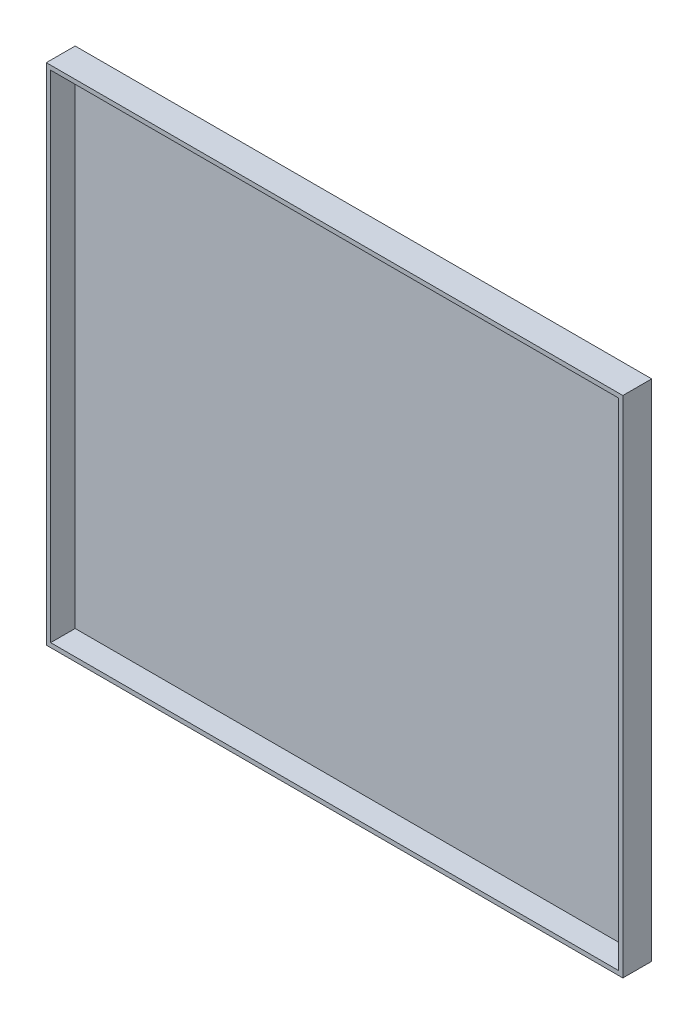
ISO-10303-21;
HEADER;
FILE_DESCRIPTION(('STEP AP214'),'2;1');
FILE_NAME('part.step','',(''),(''),'','','');
FILE_SCHEMA(('AUTOMOTIVE_DESIGN { 1 0 10303 214 1 1 1 1 }'));
ENDSEC;
DATA;
#1=APPLICATION_CONTEXT('core data for automotive mechanical design processes');
#2=APPLICATION_PROTOCOL_DEFINITION('international standard','automotive_design',2000,#1);
#3=PRODUCT_CONTEXT('',#1,'mechanical');
#4=PRODUCT('Part','Part','',(#3));
#5=PRODUCT_RELATED_PRODUCT_CATEGORY('part','',(#4));
#6=PRODUCT_DEFINITION_FORMATION('','',#4);
#7=PRODUCT_DEFINITION_CONTEXT('part definition',#1,'design');
#8=PRODUCT_DEFINITION('design','',#6,#7);
#9=PRODUCT_DEFINITION_SHAPE('','',#8);
#10=(LENGTH_UNIT() NAMED_UNIT(*) SI_UNIT(.MILLI.,.METRE.));
#11=(NAMED_UNIT(*) PLANE_ANGLE_UNIT() SI_UNIT($,.RADIAN.));
#12=(NAMED_UNIT(*) SI_UNIT($,.STERADIAN.) SOLID_ANGLE_UNIT());
#13=UNCERTAINTY_MEASURE_WITH_UNIT(LENGTH_MEASURE(1.E-05),#10,'distance_accuracy_value','');
#14=(GEOMETRIC_REPRESENTATION_CONTEXT(3) GLOBAL_UNCERTAINTY_ASSIGNED_CONTEXT((#13)) GLOBAL_UNIT_ASSIGNED_CONTEXT((#10,
#11,#12)) REPRESENTATION_CONTEXT('',''));
#15=CARTESIAN_POINT('',(0.,0.,0.));
#16=DIRECTION('',(0.,0.,1.));
#17=DIRECTION('',(1.,0.,0.));
#18=AXIS2_PLACEMENT_3D('',#15,#16,#17);
#19=CARTESIAN_POINT('',(200.,175.,20.));
#20=DIRECTION('',(-1.,0.,0.));
#21=DIRECTION('',(0.,-1.,0.));
#22=AXIS2_PLACEMENT_3D('',#19,#20,#21);
#23=PLANE('',#22);
#24=DIRECTION('',(0.,1.,0.));
#25=VECTOR('',#24,1.);
#26=CARTESIAN_POINT('',(200.,175.,0.));
#27=LINE('',#26,#25);
#28=CARTESIAN_POINT('',(200.,-175.,0.));
#29=VERTEX_POINT('',#28);
#30=CARTESIAN_POINT('',(200.,175.,0.));
#31=VERTEX_POINT('',#30);
#32=EDGE_CURVE('E149',#29,#31,#27,.T.);
#33=ORIENTED_EDGE('',*,*,#32,.T.);
#34=DIRECTION('',(0.,0.,-1.));
#35=VECTOR('',#34,1.);
#36=CARTESIAN_POINT('',(200.,175.,20.));
#37=LINE('',#36,#35);
#38=CARTESIAN_POINT('',(200.,175.,20.));
#39=VERTEX_POINT('',#38);
#40=EDGE_CURVE('E11',#39,#31,#37,.T.);
#41=ORIENTED_EDGE('',*,*,#40,.F.);
#42=DIRECTION('',(0.,1.,0.));
#43=VECTOR('',#42,1.);
#44=CARTESIAN_POINT('',(200.,175.,20.));
#45=LINE('',#44,#43);
#46=CARTESIAN_POINT('',(200.,-175.,20.));
#47=VERTEX_POINT('',#46);
#48=EDGE_CURVE('E142',#47,#39,#45,.T.);
#49=ORIENTED_EDGE('',*,*,#48,.F.);
#50=DIRECTION('',(0.,0.,-1.));
#51=VECTOR('',#50,1.);
#52=CARTESIAN_POINT('',(200.,-175.,20.));
#53=LINE('',#52,#51);
#54=EDGE_CURVE('E148',#47,#29,#53,.T.);
#55=ORIENTED_EDGE('',*,*,#54,.T.);
#56=EDGE_LOOP('',(#33,#41,#49,#55));
#57=FACE_BOUND('',#56,.T.);
#58=ADVANCED_FACE('F35',(#57),#23,.F.);
#59=CARTESIAN_POINT('',(-200.,175.,20.));
#60=DIRECTION('',(0.,-1.,0.));
#61=DIRECTION('',(0.,0.,-1.));
#62=AXIS2_PLACEMENT_3D('',#59,#60,#61);
#63=PLANE('',#62);
#64=DIRECTION('',(-1.,0.,0.));
#65=VECTOR('',#64,1.);
#66=CARTESIAN_POINT('',(-200.,175.,0.));
#67=LINE('',#66,#65);
#68=CARTESIAN_POINT('',(-200.,175.,0.));
#69=VERTEX_POINT('',#68);
#70=EDGE_CURVE('E152',#31,#69,#67,.T.);
#71=ORIENTED_EDGE('',*,*,#70,.T.);
#72=DIRECTION('',(0.,0.,-1.));
#73=VECTOR('',#72,1.);
#74=CARTESIAN_POINT('',(-200.,175.,20.));
#75=LINE('',#74,#73);
#76=CARTESIAN_POINT('',(-200.,175.,20.));
#77=VERTEX_POINT('',#76);
#78=EDGE_CURVE('E42',#77,#69,#75,.T.);
#79=ORIENTED_EDGE('',*,*,#78,.F.);
#80=DIRECTION('',(-1.,0.,0.));
#81=VECTOR('',#80,1.);
#82=CARTESIAN_POINT('',(-200.,175.,20.));
#83=LINE('',#82,#81);
#84=EDGE_CURVE('E86',#39,#77,#83,.T.);
#85=ORIENTED_EDGE('',*,*,#84,.F.);
#86=ORIENTED_EDGE('',*,*,#40,.T.);
#87=EDGE_LOOP('',(#71,#79,#85,#86));
#88=FACE_BOUND('',#87,.T.);
#89=ADVANCED_FACE('F181',(#88),#63,.F.);
#90=CARTESIAN_POINT('',(-200.,175.,20.));
#91=DIRECTION('',(1.,0.,0.));
#92=DIRECTION('',(0.,1.,0.));
#93=AXIS2_PLACEMENT_3D('',#90,#91,#92);
#94=PLANE('',#93);
#95=DIRECTION('',(0.,-1.,0.));
#96=VECTOR('',#95,1.);
#97=CARTESIAN_POINT('',(-200.,175.,0.));
#98=LINE('',#97,#96);
#99=CARTESIAN_POINT('',(-200.,-175.,0.));
#100=VERTEX_POINT('',#99);
#101=EDGE_CURVE('E154',#69,#100,#98,.T.);
#102=ORIENTED_EDGE('',*,*,#101,.T.);
#103=DIRECTION('',(0.,0.,-1.));
#104=VECTOR('',#103,1.);
#105=CARTESIAN_POINT('',(-200.,-175.,20.));
#106=LINE('',#105,#104);
#107=CARTESIAN_POINT('',(-200.,-175.,20.));
#108=VERTEX_POINT('',#107);
#109=EDGE_CURVE('E158',#108,#100,#106,.T.);
#110=ORIENTED_EDGE('',*,*,#109,.F.);
#111=DIRECTION('',(0.,-1.,0.));
#112=VECTOR('',#111,1.);
#113=CARTESIAN_POINT('',(-200.,175.,20.));
#114=LINE('',#113,#112);
#115=EDGE_CURVE('E145',#77,#108,#114,.T.);
#116=ORIENTED_EDGE('',*,*,#115,.F.);
#117=ORIENTED_EDGE('',*,*,#78,.T.);
#118=EDGE_LOOP('',(#102,#110,#116,#117));
#119=FACE_BOUND('',#118,.T.);
#120=ADVANCED_FACE('F163',(#119),#94,.F.);
#121=CARTESIAN_POINT('',(-200.,-175.,20.));
#122=DIRECTION('',(0.,1.,0.));
#123=DIRECTION('',(0.,0.,1.));
#124=AXIS2_PLACEMENT_3D('',#121,#122,#123);
#125=PLANE('',#124);
#126=DIRECTION('',(1.,0.,0.));
#127=VECTOR('',#126,1.);
#128=CARTESIAN_POINT('',(-200.,-175.,0.));
#129=LINE('',#128,#127);
#130=EDGE_CURVE('E79',#100,#29,#129,.T.);
#131=ORIENTED_EDGE('',*,*,#130,.T.);
#132=ORIENTED_EDGE('',*,*,#54,.F.);
#133=DIRECTION('',(1.,0.,0.));
#134=VECTOR('',#133,1.);
#135=CARTESIAN_POINT('',(-200.,-175.,20.));
#136=LINE('',#135,#134);
#137=EDGE_CURVE('E58',#108,#47,#136,.T.);
#138=ORIENTED_EDGE('',*,*,#137,.F.);
#139=ORIENTED_EDGE('',*,*,#109,.T.);
#140=EDGE_LOOP('',(#131,#132,#138,#139));
#141=FACE_BOUND('',#140,.T.);
#142=ADVANCED_FACE('F171',(#141),#125,.F.);
#143=CARTESIAN_POINT('',(0.,0.,20.));
#144=DIRECTION('',(0.,0.,1.));
#145=DIRECTION('',(1.,0.,0.));
#146=AXIS2_PLACEMENT_3D('',#143,#144,#145);
#147=PLANE('',#146);
#148=DIRECTION('',(0.,1.,0.));
#149=VECTOR('',#148,1.);
#150=CARTESIAN_POINT('',(197.,175.,20.));
#151=LINE('',#150,#149);
#152=CARTESIAN_POINT('',(197.,-172.,20.));
#153=VERTEX_POINT('',#152);
#154=CARTESIAN_POINT('',(197.,172.,20.));
#155=VERTEX_POINT('',#154);
#156=EDGE_CURVE('E131',#153,#155,#151,.T.);
#157=ORIENTED_EDGE('',*,*,#156,.F.);
#158=DIRECTION('',(1.,0.,0.));
#159=VECTOR('',#158,1.);
#160=CARTESIAN_POINT('',(-200.,-172.,20.));
#161=LINE('',#160,#159);
#162=CARTESIAN_POINT('',(-197.,-172.,20.));
#163=VERTEX_POINT('',#162);
#164=EDGE_CURVE('E140',#163,#153,#161,.T.);
#165=ORIENTED_EDGE('',*,*,#164,.F.);
#166=DIRECTION('',(0.,-1.,0.));
#167=VECTOR('',#166,1.);
#168=CARTESIAN_POINT('',(-197.,175.,20.));
#169=LINE('',#168,#167);
#170=CARTESIAN_POINT('',(-197.,172.,20.));
#171=VERTEX_POINT('',#170);
#172=EDGE_CURVE('E138',#171,#163,#169,.T.);
#173=ORIENTED_EDGE('',*,*,#172,.F.);
#174=DIRECTION('',(-1.,0.,0.));
#175=VECTOR('',#174,1.);
#176=CARTESIAN_POINT('',(-200.,172.,20.));
#177=LINE('',#176,#175);
#178=EDGE_CURVE('E123',#155,#171,#177,.T.);
#179=ORIENTED_EDGE('',*,*,#178,.F.);
#180=EDGE_LOOP('',(#157,#165,#173,#179));
#181=FACE_BOUND('',#180,.T.);
#182=ORIENTED_EDGE('',*,*,#48,.T.);
#183=ORIENTED_EDGE('',*,*,#84,.T.);
#184=ORIENTED_EDGE('',*,*,#115,.T.);
#185=ORIENTED_EDGE('',*,*,#137,.T.);
#186=EDGE_LOOP('',(#182,#183,#184,#185));
#187=FACE_BOUND('',#186,.T.);
#188=ADVANCED_FACE('F173',(#181,#187),#147,.T.);
#189=CARTESIAN_POINT('',(0.,0.,0.));
#190=DIRECTION('',(0.,0.,1.));
#191=DIRECTION('',(1.,0.,0.));
#192=AXIS2_PLACEMENT_3D('',#189,#190,#191);
#193=PLANE('',#192);
#194=ORIENTED_EDGE('',*,*,#32,.F.);
#195=ORIENTED_EDGE('',*,*,#130,.F.);
#196=ORIENTED_EDGE('',*,*,#101,.F.);
#197=ORIENTED_EDGE('',*,*,#70,.F.);
#198=EDGE_LOOP('',(#194,#195,#196,#197));
#199=FACE_BOUND('',#198,.T.);
#200=ADVANCED_FACE('F167',(#199),#193,.F.);
#201=CARTESIAN_POINT('',(197.,175.,20.));
#202=DIRECTION('',(-1.,0.,0.));
#203=DIRECTION('',(0.,-1.,0.));
#204=AXIS2_PLACEMENT_3D('',#201,#202,#203);
#205=PLANE('',#204);
#206=DIRECTION('',(0.,1.,0.));
#207=VECTOR('',#206,1.);
#208=CARTESIAN_POINT('',(197.,175.,3.));
#209=LINE('',#208,#207);
#210=CARTESIAN_POINT('',(197.,-172.,3.));
#211=VERTEX_POINT('',#210);
#212=CARTESIAN_POINT('',(197.,172.,3.));
#213=VERTEX_POINT('',#212);
#214=EDGE_CURVE('E114',#211,#213,#209,.T.);
#215=ORIENTED_EDGE('',*,*,#214,.F.);
#216=DIRECTION('',(0.,0.,-1.));
#217=VECTOR('',#216,1.);
#218=CARTESIAN_POINT('',(197.,-172.,20.));
#219=LINE('',#218,#217);
#220=EDGE_CURVE('E134',#153,#211,#219,.T.);
#221=ORIENTED_EDGE('',*,*,#220,.F.);
#222=ORIENTED_EDGE('',*,*,#156,.T.);
#223=DIRECTION('',(0.,0.,-1.));
#224=VECTOR('',#223,1.);
#225=CARTESIAN_POINT('',(197.,172.,20.));
#226=LINE('',#225,#224);
#227=EDGE_CURVE('E126',#155,#213,#226,.T.);
#228=ORIENTED_EDGE('',*,*,#227,.T.);
#229=EDGE_LOOP('',(#215,#221,#222,#228));
#230=FACE_BOUND('',#229,.T.);
#231=ADVANCED_FACE('F208',(#230),#205,.T.);
#232=CARTESIAN_POINT('',(-200.,172.,20.));
#233=DIRECTION('',(0.,-1.,0.));
#234=DIRECTION('',(0.,0.,-1.));
#235=AXIS2_PLACEMENT_3D('',#232,#233,#234);
#236=PLANE('',#235);
#237=DIRECTION('',(-1.,0.,0.));
#238=VECTOR('',#237,1.);
#239=CARTESIAN_POINT('',(-200.,172.,3.));
#240=LINE('',#239,#238);
#241=CARTESIAN_POINT('',(-197.,172.,3.));
#242=VERTEX_POINT('',#241);
#243=EDGE_CURVE('E108',#213,#242,#240,.T.);
#244=ORIENTED_EDGE('',*,*,#243,.F.);
#245=ORIENTED_EDGE('',*,*,#227,.F.);
#246=ORIENTED_EDGE('',*,*,#178,.T.);
#247=DIRECTION('',(0.,0.,-1.));
#248=VECTOR('',#247,1.);
#249=CARTESIAN_POINT('',(-197.,172.,20.));
#250=LINE('',#249,#248);
#251=EDGE_CURVE('E120',#171,#242,#250,.T.);
#252=ORIENTED_EDGE('',*,*,#251,.T.);
#253=EDGE_LOOP('',(#244,#245,#246,#252));
#254=FACE_BOUND('',#253,.T.);
#255=ADVANCED_FACE('F121',(#254),#236,.T.);
#256=CARTESIAN_POINT('',(-197.,175.,20.));
#257=DIRECTION('',(1.,0.,0.));
#258=DIRECTION('',(0.,1.,0.));
#259=AXIS2_PLACEMENT_3D('',#256,#257,#258);
#260=PLANE('',#259);
#261=DIRECTION('',(0.,-1.,0.));
#262=VECTOR('',#261,1.);
#263=CARTESIAN_POINT('',(-197.,175.,3.));
#264=LINE('',#263,#262);
#265=CARTESIAN_POINT('',(-197.,-172.,3.));
#266=VERTEX_POINT('',#265);
#267=EDGE_CURVE('E112',#242,#266,#264,.T.);
#268=ORIENTED_EDGE('',*,*,#267,.F.);
#269=ORIENTED_EDGE('',*,*,#251,.F.);
#270=ORIENTED_EDGE('',*,*,#172,.T.);
#271=DIRECTION('',(0.,0.,-1.));
#272=VECTOR('',#271,1.);
#273=CARTESIAN_POINT('',(-197.,-172.,20.));
#274=LINE('',#273,#272);
#275=EDGE_CURVE('E49',#163,#266,#274,.T.);
#276=ORIENTED_EDGE('',*,*,#275,.T.);
#277=EDGE_LOOP('',(#268,#269,#270,#276));
#278=FACE_BOUND('',#277,.T.);
#279=ADVANCED_FACE('F128',(#278),#260,.T.);
#280=CARTESIAN_POINT('',(-200.,-172.,20.));
#281=DIRECTION('',(0.,1.,0.));
#282=DIRECTION('',(0.,0.,1.));
#283=AXIS2_PLACEMENT_3D('',#280,#281,#282);
#284=PLANE('',#283);
#285=DIRECTION('',(1.,0.,0.));
#286=VECTOR('',#285,1.);
#287=CARTESIAN_POINT('',(-200.,-172.,3.));
#288=LINE('',#287,#286);
#289=EDGE_CURVE('E129',#266,#211,#288,.T.);
#290=ORIENTED_EDGE('',*,*,#289,.F.);
#291=ORIENTED_EDGE('',*,*,#275,.F.);
#292=ORIENTED_EDGE('',*,*,#164,.T.);
#293=ORIENTED_EDGE('',*,*,#220,.T.);
#294=EDGE_LOOP('',(#290,#291,#292,#293));
#295=FACE_BOUND('',#294,.T.);
#296=ADVANCED_FACE('F238',(#295),#284,.T.);
#297=CARTESIAN_POINT('',(0.,0.,3.));
#298=DIRECTION('',(0.,0.,1.));
#299=DIRECTION('',(1.,0.,0.));
#300=AXIS2_PLACEMENT_3D('',#297,#298,#299);
#301=PLANE('',#300);
#302=ORIENTED_EDGE('',*,*,#214,.T.);
#303=ORIENTED_EDGE('',*,*,#243,.T.);
#304=ORIENTED_EDGE('',*,*,#267,.T.);
#305=ORIENTED_EDGE('',*,*,#289,.T.);
#306=EDGE_LOOP('',(#302,#303,#304,#305));
#307=FACE_BOUND('',#306,.T.);
#308=ADVANCED_FACE('F110',(#307),#301,.T.);
#309=CLOSED_SHELL('',(#58,#89,#120,#142,#188,#200,#231,#255,#279,#296,#308));
#310=MANIFOLD_SOLID_BREP('B2',#309);
#311=ADVANCED_BREP_SHAPE_REPRESENTATION('',(#18,#310),#14);
#312=SHAPE_DEFINITION_REPRESENTATION(#9,#311);
ENDSEC;
END-ISO-10303-21;
